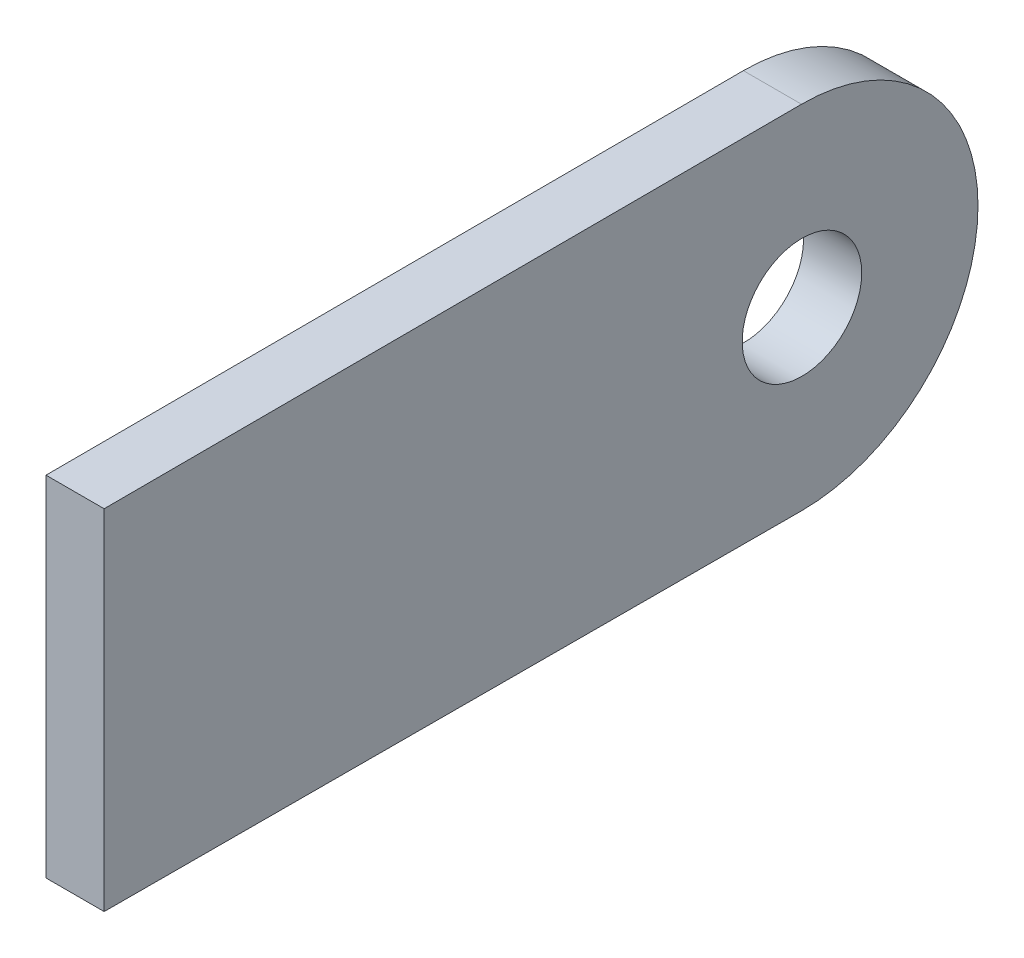
ISO-10303-21;
HEADER;
FILE_DESCRIPTION(('STEP AP214'),'2;1');
FILE_NAME('part.step','',(''),(''),'','','');
FILE_SCHEMA(('AUTOMOTIVE_DESIGN { 1 0 10303 214 1 1 1 1 }'));
ENDSEC;
DATA;
#1=APPLICATION_CONTEXT('core data for automotive mechanical design processes');
#2=APPLICATION_PROTOCOL_DEFINITION('international standard','automotive_design',2000,#1);
#3=PRODUCT_CONTEXT('',#1,'mechanical');
#4=PRODUCT('Part','Part','',(#3));
#5=PRODUCT_RELATED_PRODUCT_CATEGORY('part','',(#4));
#6=PRODUCT_DEFINITION_FORMATION('','',#4);
#7=PRODUCT_DEFINITION_CONTEXT('part definition',#1,'design');
#8=PRODUCT_DEFINITION('design','',#6,#7);
#9=PRODUCT_DEFINITION_SHAPE('','',#8);
#10=(LENGTH_UNIT() NAMED_UNIT(*) SI_UNIT(.MILLI.,.METRE.));
#11=(NAMED_UNIT(*) PLANE_ANGLE_UNIT() SI_UNIT($,.RADIAN.));
#12=(NAMED_UNIT(*) SI_UNIT($,.STERADIAN.) SOLID_ANGLE_UNIT());
#13=UNCERTAINTY_MEASURE_WITH_UNIT(LENGTH_MEASURE(1.E-05),#10,'distance_accuracy_value','');
#14=(GEOMETRIC_REPRESENTATION_CONTEXT(3) GLOBAL_UNCERTAINTY_ASSIGNED_CONTEXT((#13)) GLOBAL_UNIT_ASSIGNED_CONTEXT((#10,
#11,#12)) REPRESENTATION_CONTEXT('',''));
#15=CARTESIAN_POINT('',(0.,0.,0.));
#16=DIRECTION('',(0.,0.,1.));
#17=DIRECTION('',(1.,0.,0.));
#18=AXIS2_PLACEMENT_3D('',#15,#16,#17);
#19=CARTESIAN_POINT('',(1.5875,0.,0.));
#20=DIRECTION('',(1.,0.,0.));
#21=DIRECTION('',(0.,0.,-1.));
#22=AXIS2_PLACEMENT_3D('',#19,#20,#21);
#23=PLANE('',#22);
#24=DIRECTION('',(0.,-0.00233401428709756,0.999997276184944));
#25=VECTOR('',#24,1.);
#26=CARTESIAN_POINT('',(1.5875,9.61387381351446,0.0224389799547296));
#27=LINE('',#26,#25);
#28=CARTESIAN_POINT('',(1.5875,9.61387381351445,0.022438979954728));
#29=VERTEX_POINT('',#28);
#30=CARTESIAN_POINT('',(1.5875,9.52500000000001,38.1000000000001));
#31=VERTEX_POINT('',#30);
#32=EDGE_CURVE('E85',#29,#31,#27,.T.);
#33=ORIENTED_EDGE('',*,*,#32,.T.);
#34=DIRECTION('',(0.,-1.,0.));
#35=VECTOR('',#34,1.);
#36=CARTESIAN_POINT('',(1.5875,9.52500000000001,38.1000000000001));
#37=LINE('',#36,#35);
#38=CARTESIAN_POINT('',(1.5875,-9.52499999999999,38.1000000000001));
#39=VERTEX_POINT('',#38);
#40=EDGE_CURVE('E80',#31,#39,#37,.T.);
#41=ORIENTED_EDGE('',*,*,#40,.T.);
#42=DIRECTION('',(0.,-0.00233401428709756,-0.999997276184944));
#43=VECTOR('',#42,1.);
#44=CARTESIAN_POINT('',(1.5875,-9.61387381351443,0.0224389799547238));
#45=LINE('',#44,#43);
#46=CARTESIAN_POINT('',(1.5875,-9.61387381351443,0.0224389799547238));
#47=VERTEX_POINT('',#46);
#48=EDGE_CURVE('E83',#39,#47,#45,.T.);
#49=ORIENTED_EDGE('',*,*,#48,.T.);
#50=CARTESIAN_POINT('',(1.5875,0.,0.));
#51=DIRECTION('',(1.,0.,0.));
#52=DIRECTION('',(0.,0.,-1.));
#53=AXIS2_PLACEMENT_3D('',#50,#51,#52);
#54=CIRCLE('',#53,9.61390000000001);
#55=EDGE_CURVE('E50',#47,#29,#54,.T.);
#56=ORIENTED_EDGE('',*,*,#55,.T.);
#57=EDGE_LOOP('',(#33,#41,#49,#56));
#58=FACE_BOUND('',#57,.T.);
#59=CARTESIAN_POINT('',(1.5875,0.,0.));
#60=DIRECTION('',(1.,0.,0.));
#61=DIRECTION('',(0.,0.,-1.));
#62=AXIS2_PLACEMENT_3D('',#59,#60,#61);
#63=CIRCLE('',#62,3.2639);
#64=CARTESIAN_POINT('',(1.5875,0.,-3.2639));
#65=VERTEX_POINT('',#64);
#66=EDGE_CURVE('E100',#65,#65,#63,.T.);
#67=ORIENTED_EDGE('',*,*,#66,.F.);
#68=EDGE_LOOP('',(#67));
#69=FACE_BOUND('',#68,.T.);
#70=ADVANCED_FACE('F33',(#58,#69),#23,.T.);
#71=CARTESIAN_POINT('',(-1.5875,0.,0.));
#72=DIRECTION('',(1.,0.,0.));
#73=DIRECTION('',(0.,0.,-1.));
#74=AXIS2_PLACEMENT_3D('',#71,#72,#73);
#75=PLANE('',#74);
#76=DIRECTION('',(0.,-0.00233401428709756,0.999997276184944));
#77=VECTOR('',#76,1.);
#78=CARTESIAN_POINT('',(-1.5875,9.61387381351446,0.0224389799547296));
#79=LINE('',#78,#77);
#80=CARTESIAN_POINT('',(-1.5875,9.61387381351445,0.022438979954728));
#81=VERTEX_POINT('',#80);
#82=CARTESIAN_POINT('',(-1.5875,9.52500000000001,38.1000000000001));
#83=VERTEX_POINT('',#82);
#84=EDGE_CURVE('E97',#81,#83,#79,.T.);
#85=ORIENTED_EDGE('',*,*,#84,.F.);
#86=CARTESIAN_POINT('',(-1.5875,0.,0.));
#87=DIRECTION('',(1.,0.,0.));
#88=DIRECTION('',(0.,0.,-1.));
#89=AXIS2_PLACEMENT_3D('',#86,#87,#88);
#90=CIRCLE('',#89,9.61390000000001);
#91=CARTESIAN_POINT('',(-1.5875,-9.61387381351443,0.0224389799547238));
#92=VERTEX_POINT('',#91);
#93=EDGE_CURVE('E73',#92,#81,#90,.T.);
#94=ORIENTED_EDGE('',*,*,#93,.F.);
#95=DIRECTION('',(0.,-0.00233401428709756,-0.999997276184944));
#96=VECTOR('',#95,1.);
#97=CARTESIAN_POINT('',(-1.5875,-9.61387381351443,0.0224389799547238));
#98=LINE('',#97,#96);
#99=CARTESIAN_POINT('',(-1.5875,-9.52499999999999,38.1000000000001));
#100=VERTEX_POINT('',#99);
#101=EDGE_CURVE('E67',#100,#92,#98,.T.);
#102=ORIENTED_EDGE('',*,*,#101,.F.);
#103=DIRECTION('',(0.,-1.,0.));
#104=VECTOR('',#103,1.);
#105=CARTESIAN_POINT('',(-1.5875,9.52500000000001,38.1000000000001));
#106=LINE('',#105,#104);
#107=EDGE_CURVE('E89',#83,#100,#106,.T.);
#108=ORIENTED_EDGE('',*,*,#107,.F.);
#109=EDGE_LOOP('',(#85,#94,#102,#108));
#110=FACE_BOUND('',#109,.T.);
#111=CARTESIAN_POINT('',(-1.5875,0.,0.));
#112=DIRECTION('',(1.,0.,0.));
#113=DIRECTION('',(0.,0.,-1.));
#114=AXIS2_PLACEMENT_3D('',#111,#112,#113);
#115=CIRCLE('',#114,3.2639);
#116=CARTESIAN_POINT('',(-1.5875,0.,-3.2639));
#117=VERTEX_POINT('',#116);
#118=EDGE_CURVE('E112',#117,#117,#115,.T.);
#119=ORIENTED_EDGE('',*,*,#118,.T.);
#120=EDGE_LOOP('',(#119));
#121=FACE_BOUND('',#120,.T.);
#122=ADVANCED_FACE('F108',(#110,#121),#75,.F.);
#123=CARTESIAN_POINT('',(1.5875,9.61387381351446,0.0224389799547296));
#124=DIRECTION('',(0.,-0.999997276184944,-0.00233401428709756));
#125=DIRECTION('',(0.,0.00233401428709756,-0.999997276184944));
#126=AXIS2_PLACEMENT_3D('',#123,#124,#125);
#127=PLANE('',#126);
#128=ORIENTED_EDGE('',*,*,#84,.T.);
#129=DIRECTION('',(-1.,0.,0.));
#130=VECTOR('',#129,1.);
#131=CARTESIAN_POINT('',(1.5875,9.52500000000001,38.1000000000001));
#132=LINE('',#131,#130);
#133=EDGE_CURVE('E11',#31,#83,#132,.T.);
#134=ORIENTED_EDGE('',*,*,#133,.F.);
#135=ORIENTED_EDGE('',*,*,#32,.F.);
#136=DIRECTION('',(-1.,0.,0.));
#137=VECTOR('',#136,1.);
#138=CARTESIAN_POINT('',(1.5875,9.61387381351445,0.022438979954728));
#139=LINE('',#138,#137);
#140=EDGE_CURVE('E93',#29,#81,#139,.T.);
#141=ORIENTED_EDGE('',*,*,#140,.T.);
#142=EDGE_LOOP('',(#128,#134,#135,#141));
#143=FACE_BOUND('',#142,.T.);
#144=ADVANCED_FACE('F35',(#143),#127,.F.);
#145=CARTESIAN_POINT('',(1.5875,9.52500000000001,38.1000000000001));
#146=DIRECTION('',(0.,0.,-1.));
#147=DIRECTION('',(0.,1.,0.));
#148=AXIS2_PLACEMENT_3D('',#145,#146,#147);
#149=PLANE('',#148);
#150=ORIENTED_EDGE('',*,*,#107,.T.);
#151=DIRECTION('',(-1.,0.,0.));
#152=VECTOR('',#151,1.);
#153=CARTESIAN_POINT('',(1.5875,-9.52499999999999,38.1000000000001));
#154=LINE('',#153,#152);
#155=EDGE_CURVE('E42',#39,#100,#154,.T.);
#156=ORIENTED_EDGE('',*,*,#155,.F.);
#157=ORIENTED_EDGE('',*,*,#40,.F.);
#158=ORIENTED_EDGE('',*,*,#133,.T.);
#159=EDGE_LOOP('',(#150,#156,#157,#158));
#160=FACE_BOUND('',#159,.T.);
#161=ADVANCED_FACE('F88',(#160),#149,.F.);
#162=CARTESIAN_POINT('',(1.5875,-9.61387381351443,0.0224389799547238));
#163=DIRECTION('',(0.,0.999997276184944,-0.00233401428709756));
#164=DIRECTION('',(0.,0.00233401428709756,0.999997276184944));
#165=AXIS2_PLACEMENT_3D('',#162,#163,#164);
#166=PLANE('',#165);
#167=ORIENTED_EDGE('',*,*,#101,.T.);
#168=DIRECTION('',(-1.,0.,0.));
#169=VECTOR('',#168,1.);
#170=CARTESIAN_POINT('',(1.5875,-9.61387381351443,0.0224389799547238));
#171=LINE('',#170,#169);
#172=EDGE_CURVE('E90',#47,#92,#171,.T.);
#173=ORIENTED_EDGE('',*,*,#172,.F.);
#174=ORIENTED_EDGE('',*,*,#48,.F.);
#175=ORIENTED_EDGE('',*,*,#155,.T.);
#176=EDGE_LOOP('',(#167,#173,#174,#175));
#177=FACE_BOUND('',#176,.T.);
#178=ADVANCED_FACE('F91',(#177),#166,.F.);
#179=CARTESIAN_POINT('',(1.5875,0.,0.));
#180=DIRECTION('',(-1.,0.,0.));
#181=DIRECTION('',(0.,0.,1.));
#182=AXIS2_PLACEMENT_3D('',#179,#180,#181);
#183=CYLINDRICAL_SURFACE('',#182,9.61390000000001);
#184=ORIENTED_EDGE('',*,*,#93,.T.);
#185=ORIENTED_EDGE('',*,*,#140,.F.);
#186=ORIENTED_EDGE('',*,*,#55,.F.);
#187=ORIENTED_EDGE('',*,*,#172,.T.);
#188=EDGE_LOOP('',(#184,#185,#186,#187));
#189=FACE_BOUND('',#188,.T.);
#190=ADVANCED_FACE('F105',(#189),#183,.T.);
#191=CARTESIAN_POINT('',(1.5875,0.,0.));
#192=DIRECTION('',(-1.,0.,0.));
#193=DIRECTION('',(0.,0.,1.));
#194=AXIS2_PLACEMENT_3D('',#191,#192,#193);
#195=CYLINDRICAL_SURFACE('',#194,3.2639);
#196=ORIENTED_EDGE('',*,*,#66,.T.);
#197=EDGE_LOOP('',(#196));
#198=FACE_BOUND('',#197,.T.);
#199=ORIENTED_EDGE('',*,*,#118,.F.);
#200=EDGE_LOOP('',(#199));
#201=FACE_BOUND('',#200,.T.);
#202=ADVANCED_FACE('F118',(#198,#201),#195,.F.);
#203=CLOSED_SHELL('',(#70,#122,#144,#161,#178,#190,#202));
#204=MANIFOLD_SOLID_BREP('B2',#203);
#205=ADVANCED_BREP_SHAPE_REPRESENTATION('',(#18,#204),#14);
#206=SHAPE_DEFINITION_REPRESENTATION(#9,#205);
ENDSEC;
END-ISO-10303-21;
